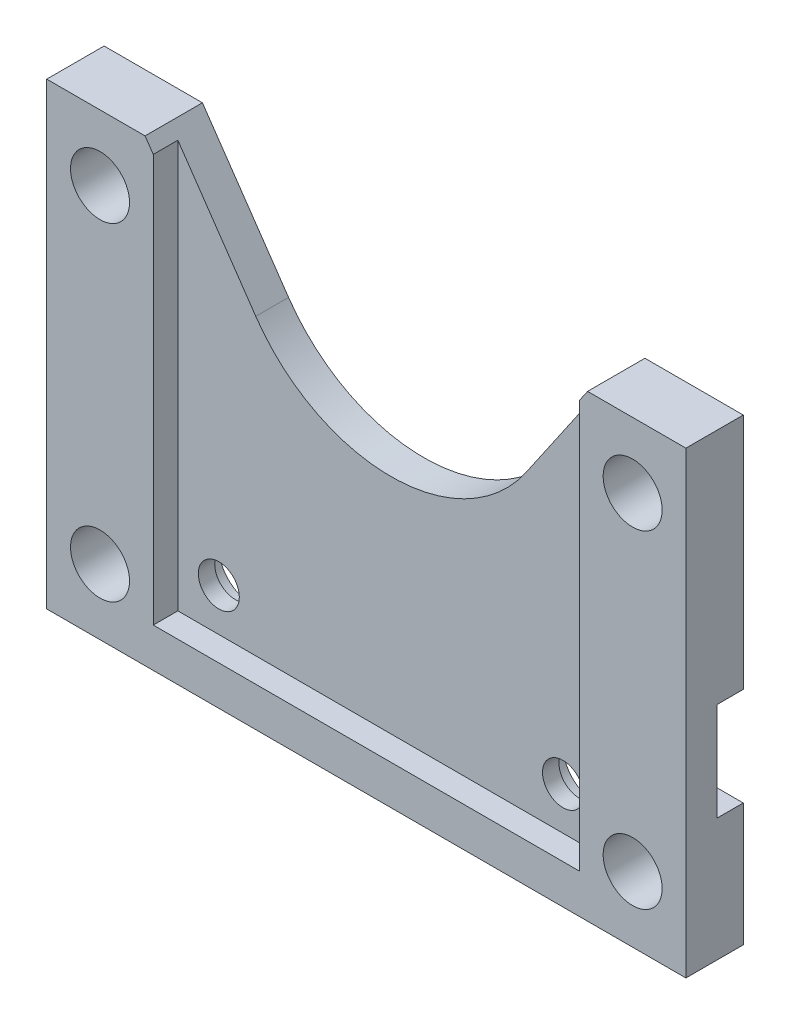
ISO-10303-21;
HEADER;
FILE_DESCRIPTION(('STEP AP214'),'2;1');
FILE_NAME('part.step','',(''),(''),'','','');
FILE_SCHEMA(('AUTOMOTIVE_DESIGN { 1 0 10303 214 1 1 1 1 }'));
ENDSEC;
DATA;
#1=APPLICATION_CONTEXT('core data for automotive mechanical design processes');
#2=APPLICATION_PROTOCOL_DEFINITION('international standard','automotive_design',2000,#1);
#3=PRODUCT_CONTEXT('',#1,'mechanical');
#4=PRODUCT('Part','Part','',(#3));
#5=PRODUCT_RELATED_PRODUCT_CATEGORY('part','',(#4));
#6=PRODUCT_DEFINITION_FORMATION('','',#4);
#7=PRODUCT_DEFINITION_CONTEXT('part definition',#1,'design');
#8=PRODUCT_DEFINITION('design','',#6,#7);
#9=PRODUCT_DEFINITION_SHAPE('','',#8);
#10=(LENGTH_UNIT() NAMED_UNIT(*) SI_UNIT(.MILLI.,.METRE.));
#11=(NAMED_UNIT(*) PLANE_ANGLE_UNIT() SI_UNIT($,.RADIAN.));
#12=(NAMED_UNIT(*) SI_UNIT($,.STERADIAN.) SOLID_ANGLE_UNIT());
#13=UNCERTAINTY_MEASURE_WITH_UNIT(LENGTH_MEASURE(1.E-05),#10,'distance_accuracy_value','');
#14=(GEOMETRIC_REPRESENTATION_CONTEXT(3) GLOBAL_UNCERTAINTY_ASSIGNED_CONTEXT((#13)) GLOBAL_UNIT_ASSIGNED_CONTEXT((#10,
#11,#12)) REPRESENTATION_CONTEXT('',''));
#15=CARTESIAN_POINT('',(0.,0.,0.));
#16=DIRECTION('',(0.,0.,1.));
#17=DIRECTION('',(1.,0.,0.));
#18=AXIS2_PLACEMENT_3D('',#15,#16,#17);
#19=CARTESIAN_POINT('',(0.,21.,0.));
#20=DIRECTION('',(0.,0.,1.));
#21=DIRECTION('',(1.,0.,0.));
#22=AXIS2_PLACEMENT_3D('',#19,#20,#21);
#23=PLANE('',#22);
#24=CARTESIAN_POINT('',(16.25,19.,0.));
#25=DIRECTION('',(0.,0.,1.));
#26=DIRECTION('',(-1.,0.,0.));
#27=AXIS2_PLACEMENT_3D('',#24,#25,#26);
#28=CIRCLE('',#27,1.8);
#29=CARTESIAN_POINT('',(14.45,19.,0.));
#30=VERTEX_POINT('',#29);
#31=EDGE_CURVE('E341',#30,#30,#28,.T.);
#32=ORIENTED_EDGE('',*,*,#31,.T.);
#33=EDGE_LOOP('',(#32));
#34=FACE_BOUND('',#33,.T.);
#35=CARTESIAN_POINT('',(-16.25,19.,0.));
#36=DIRECTION('',(0.,0.,1.));
#37=DIRECTION('',(1.,0.,0.));
#38=AXIS2_PLACEMENT_3D('',#35,#36,#37);
#39=CIRCLE('',#38,1.8);
#40=CARTESIAN_POINT('',(-14.45,19.,0.));
#41=VERTEX_POINT('',#40);
#42=EDGE_CURVE('E353',#41,#41,#39,.T.);
#43=ORIENTED_EDGE('',*,*,#42,.T.);
#44=EDGE_LOOP('',(#43));
#45=FACE_BOUND('',#44,.T.);
#46=DIRECTION('',(0.,1.,0.));
#47=VECTOR('',#46,1.);
#48=CARTESIAN_POINT('',(19.5,-5.,0.));
#49=LINE('',#48,#47);
#50=CARTESIAN_POINT('',(19.5,8.5,0.));
#51=VERTEX_POINT('',#50);
#52=CARTESIAN_POINT('',(19.5,23.,0.));
#53=VERTEX_POINT('',#52);
#54=EDGE_CURVE('E188',#51,#53,#49,.T.);
#55=ORIENTED_EDGE('',*,*,#54,.F.);
#56=DIRECTION('',(-1.,0.,0.));
#57=VECTOR('',#56,1.);
#58=CARTESIAN_POINT('',(19.5,8.5,0.));
#59=LINE('',#58,#57);
#60=CARTESIAN_POINT('',(-19.5,8.5,0.));
#61=VERTEX_POINT('',#60);
#62=EDGE_CURVE('E264',#51,#61,#59,.T.);
#63=ORIENTED_EDGE('',*,*,#62,.T.);
#64=DIRECTION('',(0.,-1.,0.));
#65=VECTOR('',#64,1.);
#66=CARTESIAN_POINT('',(-19.5,-5.,0.));
#67=LINE('',#66,#65);
#68=CARTESIAN_POINT('',(-19.5,23.,0.));
#69=VERTEX_POINT('',#68);
#70=EDGE_CURVE('E371',#69,#61,#67,.T.);
#71=ORIENTED_EDGE('',*,*,#70,.F.);
#72=DIRECTION('',(-1.,0.,0.));
#73=VECTOR('',#72,1.);
#74=CARTESIAN_POINT('',(-19.5,23.,0.));
#75=LINE('',#74,#73);
#76=CARTESIAN_POINT('',(-13.5,23.,0.));
#77=VERTEX_POINT('',#76);
#78=EDGE_CURVE('E206',#77,#69,#75,.T.);
#79=ORIENTED_EDGE('',*,*,#78,.F.);
#80=DIRECTION('',(-0.565775492304941,0.824559332193324,0.));
#81=VECTOR('',#80,1.);
#82=CARTESIAN_POINT('',(-13.5,23.,0.));
#83=LINE('',#82,#81);
#84=CARTESIAN_POINT('',(-8.24559332193325,15.3422450769506,0.));
#85=VERTEX_POINT('',#84);
#86=EDGE_CURVE('E203',#85,#77,#83,.T.);
#87=ORIENTED_EDGE('',*,*,#86,.F.);
#88=CARTESIAN_POINT('',(0.,21.,0.));
#89=DIRECTION('',(0.,0.,-1.));
#90=DIRECTION('',(1.,0.,0.));
#91=AXIS2_PLACEMENT_3D('',#88,#89,#90);
#92=CIRCLE('',#91,9.99999999999999);
#93=CARTESIAN_POINT('',(8.24559332193324,15.3422450769506,0.));
#94=VERTEX_POINT('',#93);
#95=EDGE_CURVE('E200',#94,#85,#92,.T.);
#96=ORIENTED_EDGE('',*,*,#95,.F.);
#97=DIRECTION('',(-0.565775492304941,-0.824559332193324,0.));
#98=VECTOR('',#97,1.);
#99=CARTESIAN_POINT('',(13.5,23.,0.));
#100=LINE('',#99,#98);
#101=CARTESIAN_POINT('',(13.5,23.,0.));
#102=VERTEX_POINT('',#101);
#103=EDGE_CURVE('E192',#102,#94,#100,.T.);
#104=ORIENTED_EDGE('',*,*,#103,.F.);
#105=DIRECTION('',(-1.,0.,0.));
#106=VECTOR('',#105,1.);
#107=CARTESIAN_POINT('',(19.5,23.,0.));
#108=LINE('',#107,#106);
#109=EDGE_CURVE('E187',#53,#102,#108,.T.);
#110=ORIENTED_EDGE('',*,*,#109,.F.);
#111=EDGE_LOOP('',(#55,#63,#71,#79,#87,#96,#104,#110));
#112=FACE_BOUND('',#111,.T.);
#113=ADVANCED_FACE('F45',(#34,#45,#112),#23,.F.);
#114=CARTESIAN_POINT('',(-10.5,0.,2.));
#115=DIRECTION('',(0.,0.,-1.));
#116=DIRECTION('',(-1.,0.,0.));
#117=AXIS2_PLACEMENT_3D('',#114,#115,#116);
#118=CYLINDRICAL_SURFACE('',#117,1.25);
#119=CARTESIAN_POINT('',(-10.5,0.,2.));
#120=DIRECTION('',(0.,0.,1.));
#121=DIRECTION('',(1.,0.,0.));
#122=AXIS2_PLACEMENT_3D('',#119,#120,#121);
#123=CIRCLE('',#122,1.25);
#124=CARTESIAN_POINT('',(-9.25,0.,2.));
#125=VERTEX_POINT('',#124);
#126=EDGE_CURVE('E361',#125,#125,#123,.T.);
#127=ORIENTED_EDGE('',*,*,#126,.T.);
#128=EDGE_LOOP('',(#127));
#129=FACE_BOUND('',#128,.T.);
#130=CARTESIAN_POINT('',(-10.5,0.,1.));
#131=DIRECTION('',(0.,0.,-1.));
#132=DIRECTION('',(-1.,0.,0.));
#133=AXIS2_PLACEMENT_3D('',#130,#131,#132);
#134=CIRCLE('',#133,1.25);
#135=CARTESIAN_POINT('',(-11.75,0.,1.));
#136=VERTEX_POINT('',#135);
#137=EDGE_CURVE('E49',#136,#136,#134,.T.);
#138=ORIENTED_EDGE('',*,*,#137,.T.);
#139=EDGE_LOOP('',(#138));
#140=FACE_BOUND('',#139,.T.);
#141=ADVANCED_FACE('F464',(#129,#140),#118,.F.);
#142=CARTESIAN_POINT('',(10.5,0.,2.));
#143=DIRECTION('',(0.,0.,-1.));
#144=DIRECTION('',(-1.,0.,0.));
#145=AXIS2_PLACEMENT_3D('',#142,#143,#144);
#146=CYLINDRICAL_SURFACE('',#145,1.25);
#147=CARTESIAN_POINT('',(10.5,0.,2.));
#148=DIRECTION('',(0.,0.,1.));
#149=DIRECTION('',(1.,0.,0.));
#150=AXIS2_PLACEMENT_3D('',#147,#148,#149);
#151=CIRCLE('',#150,1.25);
#152=CARTESIAN_POINT('',(11.75,0.,2.));
#153=VERTEX_POINT('',#152);
#154=EDGE_CURVE('E357',#153,#153,#151,.T.);
#155=ORIENTED_EDGE('',*,*,#154,.T.);
#156=EDGE_LOOP('',(#155));
#157=FACE_BOUND('',#156,.T.);
#158=CARTESIAN_POINT('',(10.5,0.,1.));
#159=DIRECTION('',(0.,0.,-1.));
#160=DIRECTION('',(-1.,0.,0.));
#161=AXIS2_PLACEMENT_3D('',#158,#159,#160);
#162=CIRCLE('',#161,1.25);
#163=CARTESIAN_POINT('',(9.25,0.,1.));
#164=VERTEX_POINT('',#163);
#165=EDGE_CURVE('E236',#164,#164,#162,.T.);
#166=ORIENTED_EDGE('',*,*,#165,.T.);
#167=EDGE_LOOP('',(#166));
#168=FACE_BOUND('',#167,.T.);
#169=ADVANCED_FACE('F470',(#157,#168),#146,.F.);
#170=CARTESIAN_POINT('',(0.,21.,2.));
#171=DIRECTION('',(0.,0.,1.));
#172=DIRECTION('',(1.,0.,0.));
#173=AXIS2_PLACEMENT_3D('',#170,#171,#172);
#174=PLANE('',#173);
#175=DIRECTION('',(0.,1.,0.));
#176=VECTOR('',#175,1.);
#177=CARTESIAN_POINT('',(-13.,22.2713016528569,2.));
#178=LINE('',#177,#176);
#179=CARTESIAN_POINT('',(-13.,-2.6,2.));
#180=VERTEX_POINT('',#179);
#181=CARTESIAN_POINT('',(-13.,22.2713016528569,2.));
#182=VERTEX_POINT('',#181);
#183=EDGE_CURVE('E71',#180,#182,#178,.T.);
#184=ORIENTED_EDGE('',*,*,#183,.F.);
#185=DIRECTION('',(-1.,0.,0.));
#186=VECTOR('',#185,1.);
#187=CARTESIAN_POINT('',(-13.,-2.6,2.));
#188=LINE('',#187,#186);
#189=CARTESIAN_POINT('',(13.,-2.6,2.));
#190=VERTEX_POINT('',#189);
#191=EDGE_CURVE('E321',#190,#180,#188,.T.);
#192=ORIENTED_EDGE('',*,*,#191,.F.);
#193=DIRECTION('',(0.,-1.,0.));
#194=VECTOR('',#193,1.);
#195=CARTESIAN_POINT('',(13.,22.2713016528569,2.));
#196=LINE('',#195,#194);
#197=CARTESIAN_POINT('',(13.,22.2713016528569,2.));
#198=VERTEX_POINT('',#197);
#199=EDGE_CURVE('E280',#198,#190,#196,.T.);
#200=ORIENTED_EDGE('',*,*,#199,.F.);
#201=DIRECTION('',(-0.565775492304941,-0.824559332193324,0.));
#202=VECTOR('',#201,1.);
#203=CARTESIAN_POINT('',(13.5,23.,2.));
#204=LINE('',#203,#202);
#205=CARTESIAN_POINT('',(8.24559332193324,15.3422450769506,2.));
#206=VERTEX_POINT('',#205);
#207=EDGE_CURVE('E209',#198,#206,#204,.T.);
#208=ORIENTED_EDGE('',*,*,#207,.T.);
#209=CARTESIAN_POINT('',(0.,21.,2.));
#210=DIRECTION('',(0.,0.,-1.));
#211=DIRECTION('',(1.,0.,0.));
#212=AXIS2_PLACEMENT_3D('',#209,#210,#211);
#213=CIRCLE('',#212,9.99999999999999);
#214=CARTESIAN_POINT('',(-8.24559332193325,15.3422450769506,2.));
#215=VERTEX_POINT('',#214);
#216=EDGE_CURVE('E367',#206,#215,#213,.T.);
#217=ORIENTED_EDGE('',*,*,#216,.T.);
#218=DIRECTION('',(-0.565775492304941,0.824559332193324,0.));
#219=VECTOR('',#218,1.);
#220=CARTESIAN_POINT('',(-13.5,23.,2.));
#221=LINE('',#220,#219);
#222=EDGE_CURVE('E215',#215,#182,#221,.T.);
#223=ORIENTED_EDGE('',*,*,#222,.T.);
#224=EDGE_LOOP('',(#184,#192,#200,#208,#217,#223));
#225=FACE_BOUND('',#224,.T.);
#226=ORIENTED_EDGE('',*,*,#126,.F.);
#227=EDGE_LOOP('',(#226));
#228=FACE_BOUND('',#227,.T.);
#229=ORIENTED_EDGE('',*,*,#154,.F.);
#230=EDGE_LOOP('',(#229));
#231=FACE_BOUND('',#230,.T.);
#232=ADVANCED_FACE('F409',(#225,#228,#231),#174,.T.);
#233=CARTESIAN_POINT('',(10.5,0.,0.));
#234=DIRECTION('',(0.,0.,-1.));
#235=DIRECTION('',(-1.,0.,0.));
#236=AXIS2_PLACEMENT_3D('',#233,#234,#235);
#237=CIRCLE('',#236,2.);
#238=CARTESIAN_POINT('',(8.5,0.,0.));
#239=VERTEX_POINT('',#238);
#240=EDGE_CURVE('E247',#239,#239,#237,.T.);
#241=ORIENTED_EDGE('',*,*,#240,.F.);
#242=EDGE_LOOP('',(#241));
#243=FACE_BOUND('',#242,.T.);
#244=CARTESIAN_POINT('',(-10.5,0.,0.));
#245=DIRECTION('',(0.,0.,-1.));
#246=DIRECTION('',(-1.,0.,0.));
#247=AXIS2_PLACEMENT_3D('',#244,#245,#246);
#248=CIRCLE('',#247,2.);
#249=CARTESIAN_POINT('',(-12.5,0.,0.));
#250=VERTEX_POINT('',#249);
#251=EDGE_CURVE('E253',#250,#250,#248,.T.);
#252=ORIENTED_EDGE('',*,*,#251,.F.);
#253=EDGE_LOOP('',(#252));
#254=FACE_BOUND('',#253,.T.);
#255=CARTESIAN_POINT('',(-19.5,2.5,0.));
#256=VERTEX_POINT('',#255);
#257=CARTESIAN_POINT('',(-19.5,-5.,0.));
#258=VERTEX_POINT('',#257);
#259=EDGE_CURVE('E179',#256,#258,#67,.T.);
#260=ORIENTED_EDGE('',*,*,#259,.F.);
#261=DIRECTION('',(-1.,0.,0.));
#262=VECTOR('',#261,1.);
#263=CARTESIAN_POINT('',(19.5,2.5,0.));
#264=LINE('',#263,#262);
#265=CARTESIAN_POINT('',(19.5,2.5,0.));
#266=VERTEX_POINT('',#265);
#267=EDGE_CURVE('E164',#266,#256,#264,.T.);
#268=ORIENTED_EDGE('',*,*,#267,.F.);
#269=CARTESIAN_POINT('',(19.5,-5.,0.));
#270=VERTEX_POINT('',#269);
#271=EDGE_CURVE('E178',#270,#266,#49,.T.);
#272=ORIENTED_EDGE('',*,*,#271,.F.);
#273=DIRECTION('',(1.,0.,0.));
#274=VECTOR('',#273,1.);
#275=CARTESIAN_POINT('',(19.5,-5.,0.));
#276=LINE('',#275,#274);
#277=EDGE_CURVE('E194',#258,#270,#276,.T.);
#278=ORIENTED_EDGE('',*,*,#277,.F.);
#279=EDGE_LOOP('',(#260,#268,#272,#278));
#280=FACE_BOUND('',#279,.T.);
#281=CARTESIAN_POINT('',(-16.25,-1.,0.));
#282=DIRECTION('',(0.,0.,1.));
#283=DIRECTION('',(1.,0.,0.));
#284=AXIS2_PLACEMENT_3D('',#281,#282,#283);
#285=CIRCLE('',#284,1.8);
#286=CARTESIAN_POINT('',(-14.45,-1.,0.));
#287=VERTEX_POINT('',#286);
#288=EDGE_CURVE('E349',#287,#287,#285,.T.);
#289=ORIENTED_EDGE('',*,*,#288,.T.);
#290=EDGE_LOOP('',(#289));
#291=FACE_BOUND('',#290,.T.);
#292=CARTESIAN_POINT('',(16.25,-1.,0.));
#293=DIRECTION('',(0.,0.,1.));
#294=DIRECTION('',(-1.,0.,0.));
#295=AXIS2_PLACEMENT_3D('',#292,#293,#294);
#296=CIRCLE('',#295,1.8);
#297=CARTESIAN_POINT('',(14.45,-1.,0.));
#298=VERTEX_POINT('',#297);
#299=EDGE_CURVE('E345',#298,#298,#296,.T.);
#300=ORIENTED_EDGE('',*,*,#299,.T.);
#301=EDGE_LOOP('',(#300));
#302=FACE_BOUND('',#301,.T.);
#303=ADVANCED_FACE('F175',(#243,#254,#280,#291,#302),#23,.F.);
#304=CARTESIAN_POINT('',(-19.5,-5.,2.));
#305=DIRECTION('',(1.,0.,0.));
#306=DIRECTION('',(0.,0.,-1.));
#307=AXIS2_PLACEMENT_3D('',#304,#305,#306);
#308=PLANE('',#307);
#309=ORIENTED_EDGE('',*,*,#70,.T.);
#310=DIRECTION('',(0.,0.,-1.));
#311=VECTOR('',#310,1.);
#312=CARTESIAN_POINT('',(-19.5,8.5,0.));
#313=LINE('',#312,#311);
#314=CARTESIAN_POINT('',(-19.5,8.5,1.6));
#315=VERTEX_POINT('',#314);
#316=EDGE_CURVE('E170',#315,#61,#313,.T.);
#317=ORIENTED_EDGE('',*,*,#316,.F.);
#318=DIRECTION('',(0.,1.,0.));
#319=VECTOR('',#318,1.);
#320=CARTESIAN_POINT('',(-19.5,8.5,1.6));
#321=LINE('',#320,#319);
#322=CARTESIAN_POINT('',(-19.5,2.5,1.6));
#323=VERTEX_POINT('',#322);
#324=EDGE_CURVE('E442',#323,#315,#321,.T.);
#325=ORIENTED_EDGE('',*,*,#324,.F.);
#326=DIRECTION('',(0.,0.,1.));
#327=VECTOR('',#326,1.);
#328=CARTESIAN_POINT('',(-19.5,2.5,0.));
#329=LINE('',#328,#327);
#330=EDGE_CURVE('E381',#256,#323,#329,.T.);
#331=ORIENTED_EDGE('',*,*,#330,.F.);
#332=ORIENTED_EDGE('',*,*,#259,.T.);
#333=DIRECTION('',(0.,0.,-1.));
#334=VECTOR('',#333,1.);
#335=CARTESIAN_POINT('',(-19.5,-5.,2.));
#336=LINE('',#335,#334);
#337=CARTESIAN_POINT('',(-19.5,-5.,3.5));
#338=VERTEX_POINT('',#337);
#339=EDGE_CURVE('E11',#338,#258,#336,.T.);
#340=ORIENTED_EDGE('',*,*,#339,.F.);
#341=DIRECTION('',(0.,-1.,0.));
#342=VECTOR('',#341,1.);
#343=CARTESIAN_POINT('',(-19.5,-5.,3.5));
#344=LINE('',#343,#342);
#345=CARTESIAN_POINT('',(-19.5,23.,3.5));
#346=VERTEX_POINT('',#345);
#347=EDGE_CURVE('E289',#346,#338,#344,.T.);
#348=ORIENTED_EDGE('',*,*,#347,.F.);
#349=DIRECTION('',(0.,0.,-1.));
#350=VECTOR('',#349,1.);
#351=CARTESIAN_POINT('',(-19.5,23.,2.));
#352=LINE('',#351,#350);
#353=EDGE_CURVE('E210',#346,#69,#352,.T.);
#354=ORIENTED_EDGE('',*,*,#353,.T.);
#355=EDGE_LOOP('',(#309,#317,#325,#331,#332,#340,#348,#354));
#356=FACE_BOUND('',#355,.T.);
#357=ADVANCED_FACE('F47',(#356),#308,.F.);
#358=CARTESIAN_POINT('',(19.5,-5.,2.));
#359=DIRECTION('',(0.,1.,0.));
#360=DIRECTION('',(-1.,0.,0.));
#361=AXIS2_PLACEMENT_3D('',#358,#359,#360);
#362=PLANE('',#361);
#363=ORIENTED_EDGE('',*,*,#277,.T.);
#364=DIRECTION('',(0.,0.,-1.));
#365=VECTOR('',#364,1.);
#366=CARTESIAN_POINT('',(19.5,-5.,2.));
#367=LINE('',#366,#365);
#368=CARTESIAN_POINT('',(19.5,-5.,3.5));
#369=VERTEX_POINT('',#368);
#370=EDGE_CURVE('E55',#369,#270,#367,.T.);
#371=ORIENTED_EDGE('',*,*,#370,.F.);
#372=DIRECTION('',(1.,0.,0.));
#373=VECTOR('',#372,1.);
#374=CARTESIAN_POINT('',(19.5,-5.,3.5));
#375=LINE('',#374,#373);
#376=EDGE_CURVE('E293',#338,#369,#375,.T.);
#377=ORIENTED_EDGE('',*,*,#376,.F.);
#378=ORIENTED_EDGE('',*,*,#339,.T.);
#379=EDGE_LOOP('',(#363,#371,#377,#378));
#380=FACE_BOUND('',#379,.T.);
#381=ADVANCED_FACE('F384',(#380),#362,.F.);
#382=CARTESIAN_POINT('',(19.5,-5.,2.));
#383=DIRECTION('',(-1.,0.,0.));
#384=DIRECTION('',(0.,-1.,0.));
#385=AXIS2_PLACEMENT_3D('',#382,#383,#384);
#386=PLANE('',#385);
#387=DIRECTION('',(0.,1.,0.));
#388=VECTOR('',#387,1.);
#389=CARTESIAN_POINT('',(19.5,8.5,1.6));
#390=LINE('',#389,#388);
#391=CARTESIAN_POINT('',(19.5,2.5,1.6));
#392=VERTEX_POINT('',#391);
#393=CARTESIAN_POINT('',(19.5,8.5,1.6));
#394=VERTEX_POINT('',#393);
#395=EDGE_CURVE('E63',#392,#394,#390,.T.);
#396=ORIENTED_EDGE('',*,*,#395,.T.);
#397=DIRECTION('',(0.,0.,-1.));
#398=VECTOR('',#397,1.);
#399=CARTESIAN_POINT('',(19.5,8.5,0.));
#400=LINE('',#399,#398);
#401=EDGE_CURVE('E181',#394,#51,#400,.T.);
#402=ORIENTED_EDGE('',*,*,#401,.T.);
#403=ORIENTED_EDGE('',*,*,#54,.T.);
#404=DIRECTION('',(0.,0.,-1.));
#405=VECTOR('',#404,1.);
#406=CARTESIAN_POINT('',(19.5,23.,2.));
#407=LINE('',#406,#405);
#408=CARTESIAN_POINT('',(19.5,23.,3.5));
#409=VERTEX_POINT('',#408);
#410=EDGE_CURVE('E231',#409,#53,#407,.T.);
#411=ORIENTED_EDGE('',*,*,#410,.F.);
#412=DIRECTION('',(0.,1.,0.));
#413=VECTOR('',#412,1.);
#414=CARTESIAN_POINT('',(19.5,-5.,3.5));
#415=LINE('',#414,#413);
#416=EDGE_CURVE('E297',#369,#409,#415,.T.);
#417=ORIENTED_EDGE('',*,*,#416,.F.);
#418=ORIENTED_EDGE('',*,*,#370,.T.);
#419=ORIENTED_EDGE('',*,*,#271,.T.);
#420=DIRECTION('',(0.,0.,1.));
#421=VECTOR('',#420,1.);
#422=CARTESIAN_POINT('',(19.5,2.5,0.));
#423=LINE('',#422,#421);
#424=EDGE_CURVE('E160',#266,#392,#423,.T.);
#425=ORIENTED_EDGE('',*,*,#424,.T.);
#426=EDGE_LOOP('',(#396,#402,#403,#411,#417,#418,#419,#425));
#427=FACE_BOUND('',#426,.T.);
#428=ADVANCED_FACE('F184',(#427),#386,.F.);
#429=CARTESIAN_POINT('',(19.5,23.,2.));
#430=DIRECTION('',(0.,-1.,0.));
#431=DIRECTION('',(1.,0.,0.));
#432=AXIS2_PLACEMENT_3D('',#429,#430,#431);
#433=PLANE('',#432);
#434=ORIENTED_EDGE('',*,*,#109,.T.);
#435=DIRECTION('',(0.,0.,-1.));
#436=VECTOR('',#435,1.);
#437=CARTESIAN_POINT('',(13.5,23.,2.));
#438=LINE('',#437,#436);
#439=CARTESIAN_POINT('',(13.5,23.,3.5));
#440=VERTEX_POINT('',#439);
#441=EDGE_CURVE('E227',#440,#102,#438,.T.);
#442=ORIENTED_EDGE('',*,*,#441,.F.);
#443=DIRECTION('',(-1.,0.,0.));
#444=VECTOR('',#443,1.);
#445=CARTESIAN_POINT('',(19.5,23.,3.5));
#446=LINE('',#445,#444);
#447=EDGE_CURVE('E301',#409,#440,#446,.T.);
#448=ORIENTED_EDGE('',*,*,#447,.F.);
#449=ORIENTED_EDGE('',*,*,#410,.T.);
#450=EDGE_LOOP('',(#434,#442,#448,#449));
#451=FACE_BOUND('',#450,.T.);
#452=ADVANCED_FACE('F393',(#451),#433,.F.);
#453=CARTESIAN_POINT('',(13.5,23.,2.));
#454=DIRECTION('',(0.824559332193324,-0.565775492304941,0.));
#455=DIRECTION('',(0.565775492304941,0.824559332193324,0.));
#456=AXIS2_PLACEMENT_3D('',#453,#454,#455);
#457=PLANE('',#456);
#458=ORIENTED_EDGE('',*,*,#103,.T.);
#459=DIRECTION('',(0.,0.,-1.));
#460=VECTOR('',#459,1.);
#461=CARTESIAN_POINT('',(8.24559332193324,15.3422450769506,2.));
#462=LINE('',#461,#460);
#463=EDGE_CURVE('E223',#206,#94,#462,.T.);
#464=ORIENTED_EDGE('',*,*,#463,.F.);
#465=ORIENTED_EDGE('',*,*,#207,.F.);
#466=DIRECTION('',(0.,0.,-1.));
#467=VECTOR('',#466,1.);
#468=CARTESIAN_POINT('',(13.,22.2713016528569,3.5));
#469=LINE('',#468,#467);
#470=CARTESIAN_POINT('',(13.,22.2713016528569,3.5));
#471=VERTEX_POINT('',#470);
#472=EDGE_CURVE('E337',#471,#198,#469,.T.);
#473=ORIENTED_EDGE('',*,*,#472,.F.);
#474=DIRECTION('',(-0.565775492304939,-0.824559332193326,0.));
#475=VECTOR('',#474,1.);
#476=CARTESIAN_POINT('',(13.5,23.,3.5));
#477=LINE('',#476,#475);
#478=EDGE_CURVE('E305',#440,#471,#477,.T.);
#479=ORIENTED_EDGE('',*,*,#478,.F.);
#480=ORIENTED_EDGE('',*,*,#441,.T.);
#481=EDGE_LOOP('',(#458,#464,#465,#473,#479,#480));
#482=FACE_BOUND('',#481,.T.);
#483=ADVANCED_FACE('F401',(#482),#457,.F.);
#484=CARTESIAN_POINT('',(0.,21.,2.));
#485=DIRECTION('',(0.,0.,-1.));
#486=DIRECTION('',(-1.,0.,0.));
#487=AXIS2_PLACEMENT_3D('',#484,#485,#486);
#488=CYLINDRICAL_SURFACE('',#487,9.99999999999999);
#489=ORIENTED_EDGE('',*,*,#95,.T.);
#490=DIRECTION('',(0.,0.,-1.));
#491=VECTOR('',#490,1.);
#492=CARTESIAN_POINT('',(-8.24559332193325,15.3422450769506,2.));
#493=LINE('',#492,#491);
#494=EDGE_CURVE('E219',#215,#85,#493,.T.);
#495=ORIENTED_EDGE('',*,*,#494,.F.);
#496=ORIENTED_EDGE('',*,*,#216,.F.);
#497=ORIENTED_EDGE('',*,*,#463,.T.);
#498=EDGE_LOOP('',(#489,#495,#496,#497));
#499=FACE_BOUND('',#498,.T.);
#500=ADVANCED_FACE('F406',(#499),#488,.F.);
#501=CARTESIAN_POINT('',(-13.5,23.,2.));
#502=DIRECTION('',(-0.824559332193324,-0.565775492304941,0.));
#503=DIRECTION('',(0.565775492304942,-0.824559332193325,0.));
#504=AXIS2_PLACEMENT_3D('',#501,#502,#503);
#505=PLANE('',#504);
#506=ORIENTED_EDGE('',*,*,#86,.T.);
#507=DIRECTION('',(0.,0.,-1.));
#508=VECTOR('',#507,1.);
#509=CARTESIAN_POINT('',(-13.5,23.,2.));
#510=LINE('',#509,#508);
#511=CARTESIAN_POINT('',(-13.5,23.,3.5));
#512=VERTEX_POINT('',#511);
#513=EDGE_CURVE('E214',#512,#77,#510,.T.);
#514=ORIENTED_EDGE('',*,*,#513,.F.);
#515=DIRECTION('',(-0.565775492304939,0.824559332193326,0.));
#516=VECTOR('',#515,1.);
#517=CARTESIAN_POINT('',(-13.5,23.,3.5));
#518=LINE('',#517,#516);
#519=CARTESIAN_POINT('',(-13.,22.2713016528569,3.5));
#520=VERTEX_POINT('',#519);
#521=EDGE_CURVE('E281',#520,#512,#518,.T.);
#522=ORIENTED_EDGE('',*,*,#521,.F.);
#523=DIRECTION('',(0.,0.,-1.));
#524=VECTOR('',#523,1.);
#525=CARTESIAN_POINT('',(-13.,22.2713016528569,3.5));
#526=LINE('',#525,#524);
#527=EDGE_CURVE('E317',#520,#182,#526,.T.);
#528=ORIENTED_EDGE('',*,*,#527,.T.);
#529=ORIENTED_EDGE('',*,*,#222,.F.);
#530=ORIENTED_EDGE('',*,*,#494,.T.);
#531=EDGE_LOOP('',(#506,#514,#522,#528,#529,#530));
#532=FACE_BOUND('',#531,.T.);
#533=ADVANCED_FACE('F426',(#532),#505,.F.);
#534=CARTESIAN_POINT('',(-19.5,23.,2.));
#535=DIRECTION('',(0.,-1.,0.));
#536=DIRECTION('',(1.,0.,0.));
#537=AXIS2_PLACEMENT_3D('',#534,#535,#536);
#538=PLANE('',#537);
#539=ORIENTED_EDGE('',*,*,#78,.T.);
#540=ORIENTED_EDGE('',*,*,#353,.F.);
#541=DIRECTION('',(-1.,0.,0.));
#542=VECTOR('',#541,1.);
#543=CARTESIAN_POINT('',(-19.5,23.,3.5));
#544=LINE('',#543,#542);
#545=EDGE_CURVE('E285',#512,#346,#544,.T.);
#546=ORIENTED_EDGE('',*,*,#545,.F.);
#547=ORIENTED_EDGE('',*,*,#513,.T.);
#548=EDGE_LOOP('',(#539,#540,#546,#547));
#549=FACE_BOUND('',#548,.T.);
#550=ADVANCED_FACE('F522',(#549),#538,.F.);
#551=CARTESIAN_POINT('',(-16.25,19.,2.));
#552=DIRECTION('',(0.,0.,-1.));
#553=DIRECTION('',(-1.,0.,0.));
#554=AXIS2_PLACEMENT_3D('',#551,#552,#553);
#555=CYLINDRICAL_SURFACE('',#554,1.8);
#556=ORIENTED_EDGE('',*,*,#42,.F.);
#557=EDGE_LOOP('',(#556));
#558=FACE_BOUND('',#557,.T.);
#559=CARTESIAN_POINT('',(-16.25,19.,3.5));
#560=DIRECTION('',(0.,0.,1.));
#561=DIRECTION('',(1.,0.,0.));
#562=AXIS2_PLACEMENT_3D('',#559,#560,#561);
#563=CIRCLE('',#562,1.8);
#564=CARTESIAN_POINT('',(-14.45,19.,3.5));
#565=VERTEX_POINT('',#564);
#566=EDGE_CURVE('E276',#565,#565,#563,.T.);
#567=ORIENTED_EDGE('',*,*,#566,.T.);
#568=EDGE_LOOP('',(#567));
#569=FACE_BOUND('',#568,.T.);
#570=ADVANCED_FACE('F518',(#558,#569),#555,.F.);
#571=CARTESIAN_POINT('',(-16.25,-1.,2.));
#572=DIRECTION('',(0.,0.,-1.));
#573=DIRECTION('',(-1.,0.,0.));
#574=AXIS2_PLACEMENT_3D('',#571,#572,#573);
#575=CYLINDRICAL_SURFACE('',#574,1.8);
#576=ORIENTED_EDGE('',*,*,#288,.F.);
#577=EDGE_LOOP('',(#576));
#578=FACE_BOUND('',#577,.T.);
#579=CARTESIAN_POINT('',(-16.25,-1.,3.5));
#580=DIRECTION('',(0.,0.,1.));
#581=DIRECTION('',(1.,0.,0.));
#582=AXIS2_PLACEMENT_3D('',#579,#580,#581);
#583=CIRCLE('',#582,1.8);
#584=CARTESIAN_POINT('',(-14.45,-1.,3.5));
#585=VERTEX_POINT('',#584);
#586=EDGE_CURVE('E272',#585,#585,#583,.T.);
#587=ORIENTED_EDGE('',*,*,#586,.T.);
#588=EDGE_LOOP('',(#587));
#589=FACE_BOUND('',#588,.T.);
#590=ADVANCED_FACE('F514',(#578,#589),#575,.F.);
#591=CARTESIAN_POINT('',(16.25,-1.,2.));
#592=DIRECTION('',(0.,0.,-1.));
#593=DIRECTION('',(-1.,0.,0.));
#594=AXIS2_PLACEMENT_3D('',#591,#592,#593);
#595=CYLINDRICAL_SURFACE('',#594,1.8);
#596=ORIENTED_EDGE('',*,*,#299,.F.);
#597=EDGE_LOOP('',(#596));
#598=FACE_BOUND('',#597,.T.);
#599=CARTESIAN_POINT('',(16.25,-1.,3.5));
#600=DIRECTION('',(0.,0.,1.));
#601=DIRECTION('',(-1.,0.,0.));
#602=AXIS2_PLACEMENT_3D('',#599,#600,#601);
#603=CIRCLE('',#602,1.8);
#604=CARTESIAN_POINT('',(14.45,-1.,3.5));
#605=VERTEX_POINT('',#604);
#606=EDGE_CURVE('E268',#605,#605,#603,.T.);
#607=ORIENTED_EDGE('',*,*,#606,.T.);
#608=EDGE_LOOP('',(#607));
#609=FACE_BOUND('',#608,.T.);
#610=ADVANCED_FACE('F510',(#598,#609),#595,.F.);
#611=CARTESIAN_POINT('',(16.25,19.,2.));
#612=DIRECTION('',(0.,0.,-1.));
#613=DIRECTION('',(-1.,0.,0.));
#614=AXIS2_PLACEMENT_3D('',#611,#612,#613);
#615=CYLINDRICAL_SURFACE('',#614,1.8);
#616=ORIENTED_EDGE('',*,*,#31,.F.);
#617=EDGE_LOOP('',(#616));
#618=FACE_BOUND('',#617,.T.);
#619=CARTESIAN_POINT('',(16.25,19.,3.5));
#620=DIRECTION('',(0.,0.,1.));
#621=DIRECTION('',(-1.,0.,0.));
#622=AXIS2_PLACEMENT_3D('',#619,#620,#621);
#623=CIRCLE('',#622,1.8);
#624=CARTESIAN_POINT('',(14.45,19.,3.5));
#625=VERTEX_POINT('',#624);
#626=EDGE_CURVE('E245',#625,#625,#623,.T.);
#627=ORIENTED_EDGE('',*,*,#626,.T.);
#628=EDGE_LOOP('',(#627));
#629=FACE_BOUND('',#628,.T.);
#630=ADVANCED_FACE('F501',(#618,#629),#615,.F.);
#631=CARTESIAN_POINT('',(0.,0.,3.5));
#632=DIRECTION('',(0.,0.,-1.));
#633=DIRECTION('',(-1.,0.,0.));
#634=AXIS2_PLACEMENT_3D('',#631,#632,#633);
#635=PLANE('',#634);
#636=ORIENTED_EDGE('',*,*,#521,.T.);
#637=ORIENTED_EDGE('',*,*,#545,.T.);
#638=ORIENTED_EDGE('',*,*,#347,.T.);
#639=ORIENTED_EDGE('',*,*,#376,.T.);
#640=ORIENTED_EDGE('',*,*,#416,.T.);
#641=ORIENTED_EDGE('',*,*,#447,.T.);
#642=ORIENTED_EDGE('',*,*,#478,.T.);
#643=DIRECTION('',(0.,-1.,0.));
#644=VECTOR('',#643,1.);
#645=CARTESIAN_POINT('',(13.,22.2713016528569,3.5));
#646=LINE('',#645,#644);
#647=CARTESIAN_POINT('',(13.,-2.6,3.5));
#648=VERTEX_POINT('',#647);
#649=EDGE_CURVE('E308',#471,#648,#646,.T.);
#650=ORIENTED_EDGE('',*,*,#649,.T.);
#651=DIRECTION('',(-1.,0.,0.));
#652=VECTOR('',#651,1.);
#653=CARTESIAN_POINT('',(-13.,-2.6,3.5));
#654=LINE('',#653,#652);
#655=CARTESIAN_POINT('',(-13.,-2.6,3.5));
#656=VERTEX_POINT('',#655);
#657=EDGE_CURVE('E311',#648,#656,#654,.T.);
#658=ORIENTED_EDGE('',*,*,#657,.T.);
#659=DIRECTION('',(0.,1.,0.));
#660=VECTOR('',#659,1.);
#661=CARTESIAN_POINT('',(-13.,22.2713016528569,3.5));
#662=LINE('',#661,#660);
#663=EDGE_CURVE('E314',#656,#520,#662,.T.);
#664=ORIENTED_EDGE('',*,*,#663,.T.);
#665=EDGE_LOOP('',(#636,#637,#638,#639,#640,#641,#642,#650,#658,#664));
#666=FACE_BOUND('',#665,.T.);
#667=ORIENTED_EDGE('',*,*,#566,.F.);
#668=EDGE_LOOP('',(#667));
#669=FACE_BOUND('',#668,.T.);
#670=ORIENTED_EDGE('',*,*,#586,.F.);
#671=EDGE_LOOP('',(#670));
#672=FACE_BOUND('',#671,.T.);
#673=ORIENTED_EDGE('',*,*,#606,.F.);
#674=EDGE_LOOP('',(#673));
#675=FACE_BOUND('',#674,.T.);
#676=ORIENTED_EDGE('',*,*,#626,.F.);
#677=EDGE_LOOP('',(#676));
#678=FACE_BOUND('',#677,.T.);
#679=ADVANCED_FACE('F386',(#666,#669,#672,#675,#678),#635,.F.);
#680=CARTESIAN_POINT('',(13.,22.2713016528569,3.5));
#681=DIRECTION('',(1.,0.,0.));
#682=DIRECTION('',(0.,0.,-1.));
#683=AXIS2_PLACEMENT_3D('',#680,#681,#682);
#684=PLANE('',#683);
#685=ORIENTED_EDGE('',*,*,#199,.T.);
#686=DIRECTION('',(0.,0.,-1.));
#687=VECTOR('',#686,1.);
#688=CARTESIAN_POINT('',(13.,-2.6,3.5));
#689=LINE('',#688,#687);
#690=EDGE_CURVE('E333',#648,#190,#689,.T.);
#691=ORIENTED_EDGE('',*,*,#690,.F.);
#692=ORIENTED_EDGE('',*,*,#649,.F.);
#693=ORIENTED_EDGE('',*,*,#472,.T.);
#694=EDGE_LOOP('',(#685,#691,#692,#693));
#695=FACE_BOUND('',#694,.T.);
#696=ADVANCED_FACE('F414',(#695),#684,.F.);
#697=CARTESIAN_POINT('',(-13.,-2.6,3.5));
#698=DIRECTION('',(0.,-1.,0.));
#699=DIRECTION('',(0.,0.,-1.));
#700=AXIS2_PLACEMENT_3D('',#697,#698,#699);
#701=PLANE('',#700);
#702=ORIENTED_EDGE('',*,*,#191,.T.);
#703=DIRECTION('',(0.,0.,-1.));
#704=VECTOR('',#703,1.);
#705=CARTESIAN_POINT('',(-13.,-2.6,3.5));
#706=LINE('',#705,#704);
#707=EDGE_CURVE('E329',#656,#180,#706,.T.);
#708=ORIENTED_EDGE('',*,*,#707,.F.);
#709=ORIENTED_EDGE('',*,*,#657,.F.);
#710=ORIENTED_EDGE('',*,*,#690,.T.);
#711=EDGE_LOOP('',(#702,#708,#709,#710));
#712=FACE_BOUND('',#711,.T.);
#713=ADVANCED_FACE('F421',(#712),#701,.F.);
#714=CARTESIAN_POINT('',(-13.,22.2713016528569,3.5));
#715=DIRECTION('',(-1.,0.,0.));
#716=DIRECTION('',(0.,0.,1.));
#717=AXIS2_PLACEMENT_3D('',#714,#715,#716);
#718=PLANE('',#717);
#719=ORIENTED_EDGE('',*,*,#183,.T.);
#720=ORIENTED_EDGE('',*,*,#527,.F.);
#721=ORIENTED_EDGE('',*,*,#663,.F.);
#722=ORIENTED_EDGE('',*,*,#707,.T.);
#723=EDGE_LOOP('',(#719,#720,#721,#722));
#724=FACE_BOUND('',#723,.T.);
#725=ADVANCED_FACE('F423',(#724),#718,.F.);
#726=CARTESIAN_POINT('',(10.5,0.,1.));
#727=DIRECTION('',(0.,0.,-1.));
#728=DIRECTION('',(-1.,0.,0.));
#729=AXIS2_PLACEMENT_3D('',#726,#727,#728);
#730=CYLINDRICAL_SURFACE('',#729,2.);
#731=CARTESIAN_POINT('',(10.5,0.,1.));
#732=DIRECTION('',(0.,0.,-1.));
#733=DIRECTION('',(-1.,0.,0.));
#734=AXIS2_PLACEMENT_3D('',#731,#732,#733);
#735=CIRCLE('',#734,2.);
#736=CARTESIAN_POINT('',(8.5,0.,1.));
#737=VERTEX_POINT('',#736);
#738=EDGE_CURVE('E239',#737,#737,#735,.T.);
#739=ORIENTED_EDGE('',*,*,#738,.F.);
#740=EDGE_LOOP('',(#739));
#741=FACE_BOUND('',#740,.T.);
#742=ORIENTED_EDGE('',*,*,#240,.T.);
#743=EDGE_LOOP('',(#742));
#744=FACE_BOUND('',#743,.T.);
#745=ADVANCED_FACE('F493',(#741,#744),#730,.F.);
#746=CARTESIAN_POINT('',(10.5,0.,1.));
#747=DIRECTION('',(0.,0.,-1.));
#748=DIRECTION('',(-1.,0.,0.));
#749=AXIS2_PLACEMENT_3D('',#746,#747,#748);
#750=PLANE('',#749);
#751=ORIENTED_EDGE('',*,*,#165,.F.);
#752=EDGE_LOOP('',(#751));
#753=FACE_BOUND('',#752,.T.);
#754=ORIENTED_EDGE('',*,*,#738,.T.);
#755=EDGE_LOOP('',(#754));
#756=FACE_BOUND('',#755,.T.);
#757=ADVANCED_FACE('F487',(#753,#756),#750,.T.);
#758=CARTESIAN_POINT('',(-10.5,0.,1.));
#759=DIRECTION('',(0.,0.,-1.));
#760=DIRECTION('',(-1.,0.,0.));
#761=AXIS2_PLACEMENT_3D('',#758,#759,#760);
#762=CYLINDRICAL_SURFACE('',#761,2.);
#763=CARTESIAN_POINT('',(-10.5,0.,1.));
#764=DIRECTION('',(0.,0.,-1.));
#765=DIRECTION('',(-1.,0.,0.));
#766=AXIS2_PLACEMENT_3D('',#763,#764,#765);
#767=CIRCLE('',#766,2.);
#768=CARTESIAN_POINT('',(-12.5,0.,1.));
#769=VERTEX_POINT('',#768);
#770=EDGE_CURVE('E260',#769,#769,#767,.T.);
#771=ORIENTED_EDGE('',*,*,#770,.F.);
#772=EDGE_LOOP('',(#771));
#773=FACE_BOUND('',#772,.T.);
#774=ORIENTED_EDGE('',*,*,#251,.T.);
#775=EDGE_LOOP('',(#774));
#776=FACE_BOUND('',#775,.T.);
#777=ADVANCED_FACE('F460',(#773,#776),#762,.F.);
#778=CARTESIAN_POINT('',(-10.5,0.,1.));
#779=DIRECTION('',(0.,0.,-1.));
#780=DIRECTION('',(-1.,0.,0.));
#781=AXIS2_PLACEMENT_3D('',#778,#779,#780);
#782=PLANE('',#781);
#783=ORIENTED_EDGE('',*,*,#137,.F.);
#784=EDGE_LOOP('',(#783));
#785=FACE_BOUND('',#784,.T.);
#786=ORIENTED_EDGE('',*,*,#770,.T.);
#787=EDGE_LOOP('',(#786));
#788=FACE_BOUND('',#787,.T.);
#789=ADVANCED_FACE('F453',(#785,#788),#782,.T.);
#790=CARTESIAN_POINT('',(19.5,8.5,0.));
#791=DIRECTION('',(0.,1.,0.));
#792=DIRECTION('',(0.,0.,1.));
#793=AXIS2_PLACEMENT_3D('',#790,#791,#792);
#794=PLANE('',#793);
#795=ORIENTED_EDGE('',*,*,#316,.T.);
#796=ORIENTED_EDGE('',*,*,#62,.F.);
#797=ORIENTED_EDGE('',*,*,#401,.F.);
#798=DIRECTION('',(-1.,0.,0.));
#799=VECTOR('',#798,1.);
#800=CARTESIAN_POINT('',(19.5,8.5,1.6));
#801=LINE('',#800,#799);
#802=EDGE_CURVE('E433',#394,#315,#801,.T.);
#803=ORIENTED_EDGE('',*,*,#802,.T.);
#804=EDGE_LOOP('',(#795,#796,#797,#803));
#805=FACE_BOUND('',#804,.T.);
#806=ADVANCED_FACE('F451',(#805),#794,.F.);
#807=CARTESIAN_POINT('',(19.5,8.5,1.6));
#808=DIRECTION('',(0.,0.,1.));
#809=DIRECTION('',(0.,-1.,0.));
#810=AXIS2_PLACEMENT_3D('',#807,#808,#809);
#811=PLANE('',#810);
#812=ORIENTED_EDGE('',*,*,#324,.T.);
#813=ORIENTED_EDGE('',*,*,#802,.F.);
#814=ORIENTED_EDGE('',*,*,#395,.F.);
#815=DIRECTION('',(-1.,0.,0.));
#816=VECTOR('',#815,1.);
#817=CARTESIAN_POINT('',(19.5,2.5,1.6));
#818=LINE('',#817,#816);
#819=EDGE_CURVE('E166',#392,#323,#818,.T.);
#820=ORIENTED_EDGE('',*,*,#819,.T.);
#821=EDGE_LOOP('',(#812,#813,#814,#820));
#822=FACE_BOUND('',#821,.T.);
#823=ADVANCED_FACE('F441',(#822),#811,.F.);
#824=CARTESIAN_POINT('',(19.5,2.5,0.));
#825=DIRECTION('',(0.,-1.,0.));
#826=DIRECTION('',(0.,0.,-1.));
#827=AXIS2_PLACEMENT_3D('',#824,#825,#826);
#828=PLANE('',#827);
#829=ORIENTED_EDGE('',*,*,#330,.T.);
#830=ORIENTED_EDGE('',*,*,#819,.F.);
#831=ORIENTED_EDGE('',*,*,#424,.F.);
#832=ORIENTED_EDGE('',*,*,#267,.T.);
#833=EDGE_LOOP('',(#829,#830,#831,#832));
#834=FACE_BOUND('',#833,.T.);
#835=ADVANCED_FACE('F163',(#834),#828,.F.);
#836=CLOSED_SHELL('',(#113,#141,#169,#232,#303,#357,#381,#428,#452,#483,#500,#533,#550,#570,
#590,#610,#630,#679,#696,#713,#725,#745,#757,#777,#789,#806,#823,#835));
#837=MANIFOLD_SOLID_BREP('B2',#836);
#838=ADVANCED_BREP_SHAPE_REPRESENTATION('',(#18,#837),#14);
#839=SHAPE_DEFINITION_REPRESENTATION(#9,#838);
ENDSEC;
END-ISO-10303-21;
